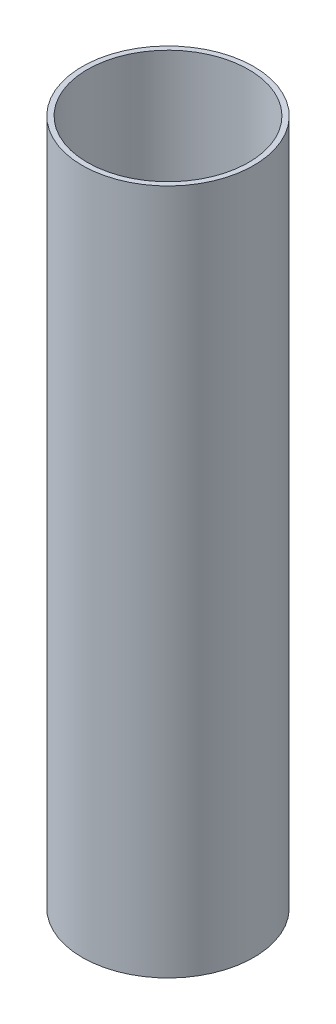
ISO-10303-21;
HEADER;
FILE_DESCRIPTION(('STEP AP214'),'2;1');
FILE_NAME('part.step','',(''),(''),'','','');
FILE_SCHEMA(('AUTOMOTIVE_DESIGN { 1 0 10303 214 1 1 1 1 }'));
ENDSEC;
DATA;
#1=APPLICATION_CONTEXT('core data for automotive mechanical design processes');
#2=APPLICATION_PROTOCOL_DEFINITION('international standard','automotive_design',2000,#1);
#3=PRODUCT_CONTEXT('',#1,'mechanical');
#4=PRODUCT('Part','Part','',(#3));
#5=PRODUCT_RELATED_PRODUCT_CATEGORY('part','',(#4));
#6=PRODUCT_DEFINITION_FORMATION('','',#4);
#7=PRODUCT_DEFINITION_CONTEXT('part definition',#1,'design');
#8=PRODUCT_DEFINITION('design','',#6,#7);
#9=PRODUCT_DEFINITION_SHAPE('','',#8);
#10=(LENGTH_UNIT() NAMED_UNIT(*) SI_UNIT(.MILLI.,.METRE.));
#11=(NAMED_UNIT(*) PLANE_ANGLE_UNIT() SI_UNIT($,.RADIAN.));
#12=(NAMED_UNIT(*) SI_UNIT($,.STERADIAN.) SOLID_ANGLE_UNIT());
#13=UNCERTAINTY_MEASURE_WITH_UNIT(LENGTH_MEASURE(1.E-05),#10,'distance_accuracy_value','');
#14=(GEOMETRIC_REPRESENTATION_CONTEXT(3) GLOBAL_UNCERTAINTY_ASSIGNED_CONTEXT((#13)) GLOBAL_UNIT_ASSIGNED_CONTEXT((#10,
#11,#12)) REPRESENTATION_CONTEXT('',''));
#15=CARTESIAN_POINT('',(0.,0.,0.));
#16=DIRECTION('',(0.,0.,1.));
#17=DIRECTION('',(1.,0.,0.));
#18=AXIS2_PLACEMENT_3D('',#15,#16,#17);
#19=CARTESIAN_POINT('',(0.,50.8,0.));
#20=DIRECTION('',(0.,1.,0.));
#21=DIRECTION('',(0.,0.,1.));
#22=AXIS2_PLACEMENT_3D('',#19,#20,#21);
#23=PLANE('',#22);
#24=CARTESIAN_POINT('',(0.,50.8,0.));
#25=DIRECTION('',(0.,1.,0.));
#26=DIRECTION('',(0.,0.,1.));
#27=AXIS2_PLACEMENT_3D('',#24,#25,#26);
#28=CIRCLE('',#27,6.35);
#29=CARTESIAN_POINT('',(0.,50.8,6.35));
#30=VERTEX_POINT('',#29);
#31=EDGE_CURVE('E10',#30,#30,#28,.T.);
#32=ORIENTED_EDGE('',*,*,#31,.T.);
#33=EDGE_LOOP('',(#32));
#34=FACE_BOUND('',#33,.T.);
#35=CARTESIAN_POINT('',(0.,50.8,0.));
#36=DIRECTION('',(0.,1.,0.));
#37=DIRECTION('',(0.,0.,1.));
#38=AXIS2_PLACEMENT_3D('',#35,#36,#37);
#39=CIRCLE('',#38,5.969);
#40=CARTESIAN_POINT('',(0.,50.8,5.969));
#41=VERTEX_POINT('',#40);
#42=EDGE_CURVE('E47',#41,#41,#39,.T.);
#43=ORIENTED_EDGE('',*,*,#42,.F.);
#44=EDGE_LOOP('',(#43));
#45=FACE_BOUND('',#44,.T.);
#46=ADVANCED_FACE('F36',(#34,#45),#23,.T.);
#47=CARTESIAN_POINT('',(0.,0.,0.));
#48=DIRECTION('',(0.,1.,0.));
#49=DIRECTION('',(0.,0.,1.));
#50=AXIS2_PLACEMENT_3D('',#47,#48,#49);
#51=PLANE('',#50);
#52=CARTESIAN_POINT('',(0.,0.,0.));
#53=DIRECTION('',(0.,1.,0.));
#54=DIRECTION('',(0.,0.,1.));
#55=AXIS2_PLACEMENT_3D('',#52,#53,#54);
#56=CIRCLE('',#55,6.35);
#57=CARTESIAN_POINT('',(0.,0.,6.35));
#58=VERTEX_POINT('',#57);
#59=EDGE_CURVE('E40',#58,#58,#56,.T.);
#60=ORIENTED_EDGE('',*,*,#59,.F.);
#61=EDGE_LOOP('',(#60));
#62=FACE_BOUND('',#61,.T.);
#63=CARTESIAN_POINT('',(0.,0.,0.));
#64=DIRECTION('',(0.,1.,0.));
#65=DIRECTION('',(0.,0.,1.));
#66=AXIS2_PLACEMENT_3D('',#63,#64,#65);
#67=CIRCLE('',#66,5.969);
#68=CARTESIAN_POINT('',(0.,0.,5.969));
#69=VERTEX_POINT('',#68);
#70=EDGE_CURVE('E49',#69,#69,#67,.T.);
#71=ORIENTED_EDGE('',*,*,#70,.T.);
#72=EDGE_LOOP('',(#71));
#73=FACE_BOUND('',#72,.T.);
#74=ADVANCED_FACE('F59',(#62,#73),#51,.F.);
#75=CARTESIAN_POINT('',(0.,50.8,0.));
#76=DIRECTION('',(0.,-1.,0.));
#77=DIRECTION('',(0.,0.,-1.));
#78=AXIS2_PLACEMENT_3D('',#75,#76,#77);
#79=CYLINDRICAL_SURFACE('',#78,6.35);
#80=ORIENTED_EDGE('',*,*,#31,.F.);
#81=EDGE_LOOP('',(#80));
#82=FACE_BOUND('',#81,.T.);
#83=ORIENTED_EDGE('',*,*,#59,.T.);
#84=EDGE_LOOP('',(#83));
#85=FACE_BOUND('',#84,.T.);
#86=ADVANCED_FACE('F38',(#82,#85),#79,.T.);
#87=CARTESIAN_POINT('',(0.,50.8,0.));
#88=DIRECTION('',(0.,-1.,0.));
#89=DIRECTION('',(0.,0.,-1.));
#90=AXIS2_PLACEMENT_3D('',#87,#88,#89);
#91=CYLINDRICAL_SURFACE('',#90,5.969);
#92=ORIENTED_EDGE('',*,*,#42,.T.);
#93=EDGE_LOOP('',(#92));
#94=FACE_BOUND('',#93,.T.);
#95=ORIENTED_EDGE('',*,*,#70,.F.);
#96=EDGE_LOOP('',(#95));
#97=FACE_BOUND('',#96,.T.);
#98=ADVANCED_FACE('F55',(#94,#97),#91,.F.);
#99=CLOSED_SHELL('',(#46,#74,#86,#98));
#100=MANIFOLD_SOLID_BREP('B2',#99);
#101=ADVANCED_BREP_SHAPE_REPRESENTATION('',(#18,#100),#14);
#102=SHAPE_DEFINITION_REPRESENTATION(#9,#101);
ENDSEC;
END-ISO-10303-21;
